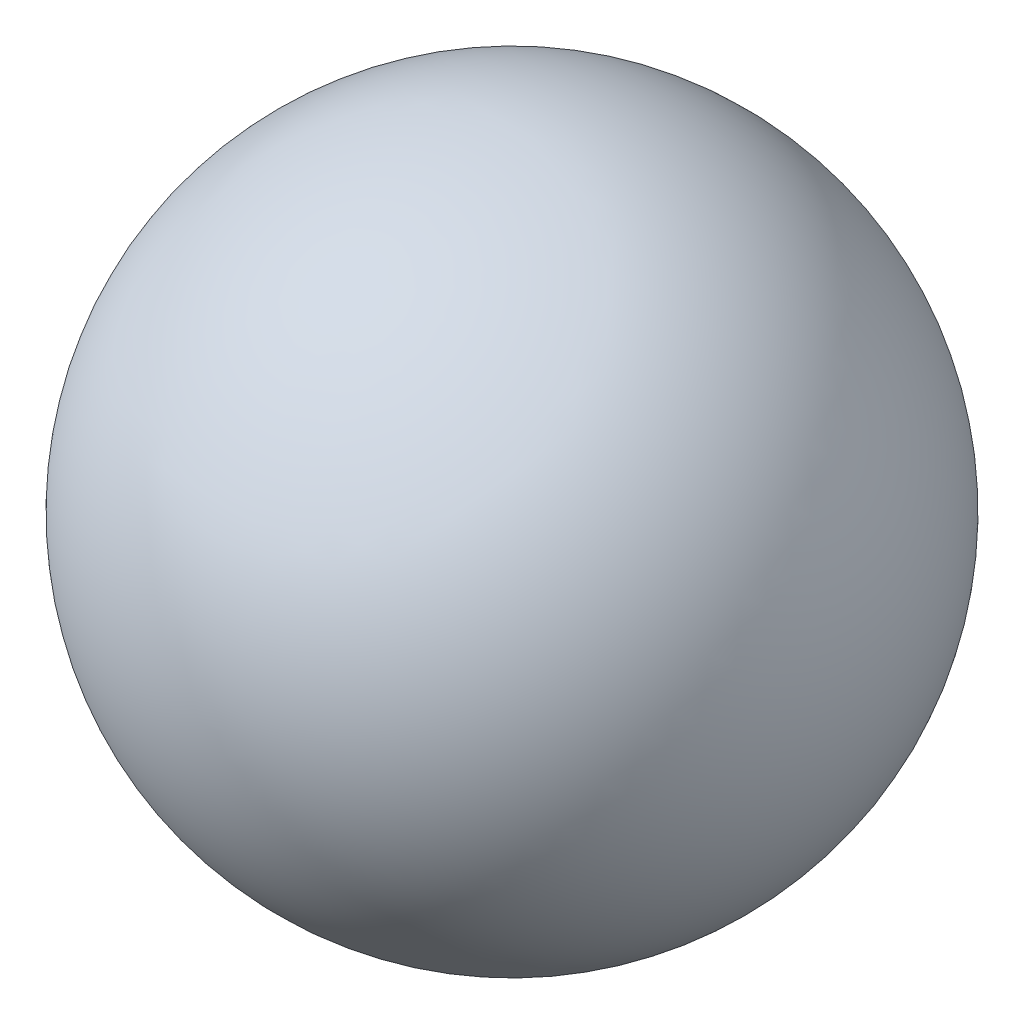
ISO-10303-21;
HEADER;
FILE_DESCRIPTION(('STEP AP214'),'2;1');
FILE_NAME('part.step','',(''),(''),'','','');
FILE_SCHEMA(('AUTOMOTIVE_DESIGN { 1 0 10303 214 1 1 1 1 }'));
ENDSEC;
DATA;
#1=APPLICATION_CONTEXT('core data for automotive mechanical design processes');
#2=APPLICATION_PROTOCOL_DEFINITION('international standard','automotive_design',2000,#1);
#3=PRODUCT_CONTEXT('',#1,'mechanical');
#4=PRODUCT('Part','Part','',(#3));
#5=PRODUCT_RELATED_PRODUCT_CATEGORY('part','',(#4));
#6=PRODUCT_DEFINITION_FORMATION('','',#4);
#7=PRODUCT_DEFINITION_CONTEXT('part definition',#1,'design');
#8=PRODUCT_DEFINITION('design','',#6,#7);
#9=PRODUCT_DEFINITION_SHAPE('','',#8);
#10=(LENGTH_UNIT() NAMED_UNIT(*) SI_UNIT(.MILLI.,.METRE.));
#11=(NAMED_UNIT(*) PLANE_ANGLE_UNIT() SI_UNIT($,.RADIAN.));
#12=(NAMED_UNIT(*) SI_UNIT($,.STERADIAN.) SOLID_ANGLE_UNIT());
#13=UNCERTAINTY_MEASURE_WITH_UNIT(LENGTH_MEASURE(1.E-05),#10,'distance_accuracy_value','');
#14=(GEOMETRIC_REPRESENTATION_CONTEXT(3) GLOBAL_UNCERTAINTY_ASSIGNED_CONTEXT((#13)) GLOBAL_UNIT_ASSIGNED_CONTEXT((#10,
#11,#12)) REPRESENTATION_CONTEXT('',''));
#15=CARTESIAN_POINT('',(0.,0.,0.));
#16=DIRECTION('',(0.,0.,1.));
#17=DIRECTION('',(1.,0.,0.));
#18=AXIS2_PLACEMENT_3D('',#15,#16,#17);
#19=CARTESIAN_POINT('',(49.75,39.048148025215,-35.8355847733911));
#20=DIRECTION('',(0.,0.736764460517836,-0.676149487700658));
#21=DIRECTION('',(0.173648177666933,0.66587725768284,0.725571352861821));
#22=AXIS2_PLACEMENT_3D('',#19,#20,#21);
#23=SPHERICAL_SURFACE('',#22,5.95);
#24=CARTESIAN_POINT('',(49.75,43.4318965652961,-39.85867422521));
#25=VERTEX_POINT('',#24);
#26=VERTEX_LOOP('',#25);
#27=FACE_BOUND('',#26,.T.);
#28=CARTESIAN_POINT('',(49.75,34.6643994851339,-31.8124953215722));
#29=VERTEX_POINT('',#28);
#30=VERTEX_LOOP('',#29);
#31=FACE_BOUND('',#30,.T.);
#32=ADVANCED_FACE('F16',(#27,#31),#23,.T.);
#33=CLOSED_SHELL('',(#32));
#34=MANIFOLD_SOLID_BREP('B1',#33);
#35=ADVANCED_BREP_SHAPE_REPRESENTATION('',(#18,#34),#14);
#36=SHAPE_DEFINITION_REPRESENTATION(#9,#35);
ENDSEC;
END-ISO-10303-21;
